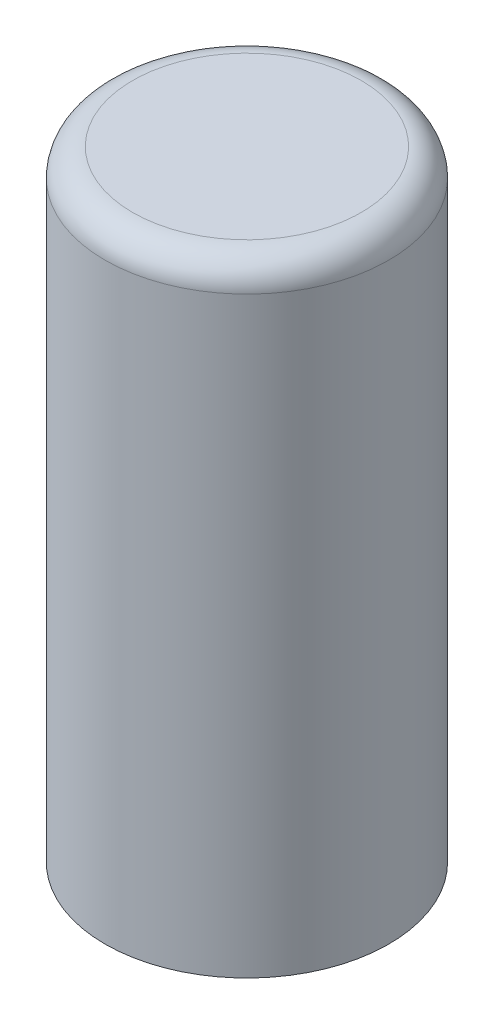
ISO-10303-21;
HEADER;
FILE_DESCRIPTION(('STEP AP214'),'2;1');
FILE_NAME('part.step','',(''),(''),'','','');
FILE_SCHEMA(('AUTOMOTIVE_DESIGN { 1 0 10303 214 1 1 1 1 }'));
ENDSEC;
DATA;
#1=APPLICATION_CONTEXT('core data for automotive mechanical design processes');
#2=APPLICATION_PROTOCOL_DEFINITION('international standard','automotive_design',2000,#1);
#3=PRODUCT_CONTEXT('',#1,'mechanical');
#4=PRODUCT('Part','Part','',(#3));
#5=PRODUCT_RELATED_PRODUCT_CATEGORY('part','',(#4));
#6=PRODUCT_DEFINITION_FORMATION('','',#4);
#7=PRODUCT_DEFINITION_CONTEXT('part definition',#1,'design');
#8=PRODUCT_DEFINITION('design','',#6,#7);
#9=PRODUCT_DEFINITION_SHAPE('','',#8);
#10=(LENGTH_UNIT() NAMED_UNIT(*) SI_UNIT(.MILLI.,.METRE.));
#11=(NAMED_UNIT(*) PLANE_ANGLE_UNIT() SI_UNIT($,.RADIAN.));
#12=(NAMED_UNIT(*) SI_UNIT($,.STERADIAN.) SOLID_ANGLE_UNIT());
#13=UNCERTAINTY_MEASURE_WITH_UNIT(LENGTH_MEASURE(1.E-05),#10,'distance_accuracy_value','');
#14=(GEOMETRIC_REPRESENTATION_CONTEXT(3) GLOBAL_UNCERTAINTY_ASSIGNED_CONTEXT((#13)) GLOBAL_UNIT_ASSIGNED_CONTEXT((#10,
#11,#12)) REPRESENTATION_CONTEXT('',''));
#15=CARTESIAN_POINT('',(0.,0.,0.));
#16=DIRECTION('',(0.,0.,1.));
#17=DIRECTION('',(1.,0.,0.));
#18=AXIS2_PLACEMENT_3D('',#15,#16,#17);
#19=CARTESIAN_POINT('',(3.383968503229,15.197980609798,-24.48169278371));
#20=DIRECTION('',(0.,1.,0.));
#21=DIRECTION('',(0.,0.,1.));
#22=AXIS2_PLACEMENT_3D('',#19,#20,#21);
#23=PLANE('',#22);
#24=CARTESIAN_POINT('',(3.383968503229,15.197980609798,-24.48169278371));
#25=DIRECTION('',(0.,-1.,0.));
#26=DIRECTION('',(0.,0.,-1.));
#27=AXIS2_PLACEMENT_3D('',#24,#25,#26);
#28=CIRCLE('',#27,2.075);
#29=CARTESIAN_POINT('',(3.383968503229,15.197980609798,-26.55669278371));
#30=VERTEX_POINT('',#29);
#31=CARTESIAN_POINT('',(3.383968503229,15.197980609798,-22.40669278371));
#32=VERTEX_POINT('',#31);
#33=EDGE_CURVE('E40',#30,#32,#28,.T.);
#34=ORIENTED_EDGE('',*,*,#33,.F.);
#35=CARTESIAN_POINT('',(3.383968503229,15.197980609798,-24.48169278371));
#36=DIRECTION('',(0.,-1.,0.));
#37=DIRECTION('',(0.,0.,1.));
#38=AXIS2_PLACEMENT_3D('',#35,#36,#37);
#39=CIRCLE('',#38,2.075);
#40=EDGE_CURVE('E34',#32,#30,#39,.T.);
#41=ORIENTED_EDGE('',*,*,#40,.F.);
#42=EDGE_LOOP('',(#34,#41));
#43=FACE_BOUND('',#42,.T.);
#44=ADVANCED_FACE('F17',(#43),#23,.T.);
#45=CARTESIAN_POINT('',(3.383968503229,14.697980609798,-24.48169278371));
#46=DIRECTION('',(0.,1.,0.));
#47=DIRECTION('',(0.,0.,1.));
#48=AXIS2_PLACEMENT_3D('',#45,#46,#47);
#49=TOROIDAL_SURFACE('',#48,2.075,0.5);
#50=ORIENTED_EDGE('',*,*,#40,.T.);
#51=ORIENTED_EDGE('',*,*,#33,.T.);
#52=EDGE_LOOP('',(#50,#51));
#53=FACE_BOUND('',#52,.T.);
#54=CARTESIAN_POINT('',(3.383968503229,14.697980609798,-24.48169278371));
#55=DIRECTION('',(0.,1.,0.));
#56=DIRECTION('',(0.,0.,1.));
#57=AXIS2_PLACEMENT_3D('',#54,#55,#56);
#58=CIRCLE('',#57,2.575);
#59=CARTESIAN_POINT('',(3.383968503229,14.697980609798,-21.90669278371));
#60=VERTEX_POINT('',#59);
#61=EDGE_CURVE('E27',#60,#60,#58,.F.);
#62=ORIENTED_EDGE('',*,*,#61,.F.);
#63=EDGE_LOOP('',(#62));
#64=FACE_BOUND('',#63,.T.);
#65=ADVANCED_FACE('F38',(#53,#64),#49,.T.);
#66=CARTESIAN_POINT('',(3.383968503229,3.947980609798,-24.48169278371));
#67=DIRECTION('',(0.,1.,0.));
#68=DIRECTION('',(0.,0.,1.));
#69=AXIS2_PLACEMENT_3D('',#66,#67,#68);
#70=PLANE('',#69);
#71=CARTESIAN_POINT('',(3.383968503229,3.947980609798,-24.48169278371));
#72=DIRECTION('',(0.,1.,0.));
#73=DIRECTION('',(0.,0.,1.));
#74=AXIS2_PLACEMENT_3D('',#71,#72,#73);
#75=CIRCLE('',#74,2.575);
#76=CARTESIAN_POINT('',(3.383968503229,3.947980609798,-21.90669278371));
#77=VERTEX_POINT('',#76);
#78=EDGE_CURVE('E11',#77,#77,#75,.T.);
#79=ORIENTED_EDGE('',*,*,#78,.F.);
#80=EDGE_LOOP('',(#79));
#81=FACE_BOUND('',#80,.T.);
#82=ADVANCED_FACE('F73',(#81),#70,.F.);
#83=CARTESIAN_POINT('',(3.383968503229,15.197980609798,-24.48169278371));
#84=DIRECTION('',(0.,1.,0.));
#85=DIRECTION('',(0.,0.,1.));
#86=AXIS2_PLACEMENT_3D('',#83,#84,#85);
#87=CYLINDRICAL_SURFACE('',#86,2.575);
#88=ORIENTED_EDGE('',*,*,#78,.T.);
#89=EDGE_LOOP('',(#88));
#90=FACE_BOUND('',#89,.T.);
#91=ORIENTED_EDGE('',*,*,#61,.T.);
#92=EDGE_LOOP('',(#91));
#93=FACE_BOUND('',#92,.T.);
#94=ADVANCED_FACE('F77',(#90,#93),#87,.T.);
#95=CLOSED_SHELL('',(#44,#65,#82,#94));
#96=MANIFOLD_SOLID_BREP('B1',#95);
#97=ADVANCED_BREP_SHAPE_REPRESENTATION('',(#18,#96),#14);
#98=SHAPE_DEFINITION_REPRESENTATION(#9,#97);
ENDSEC;
END-ISO-10303-21;
